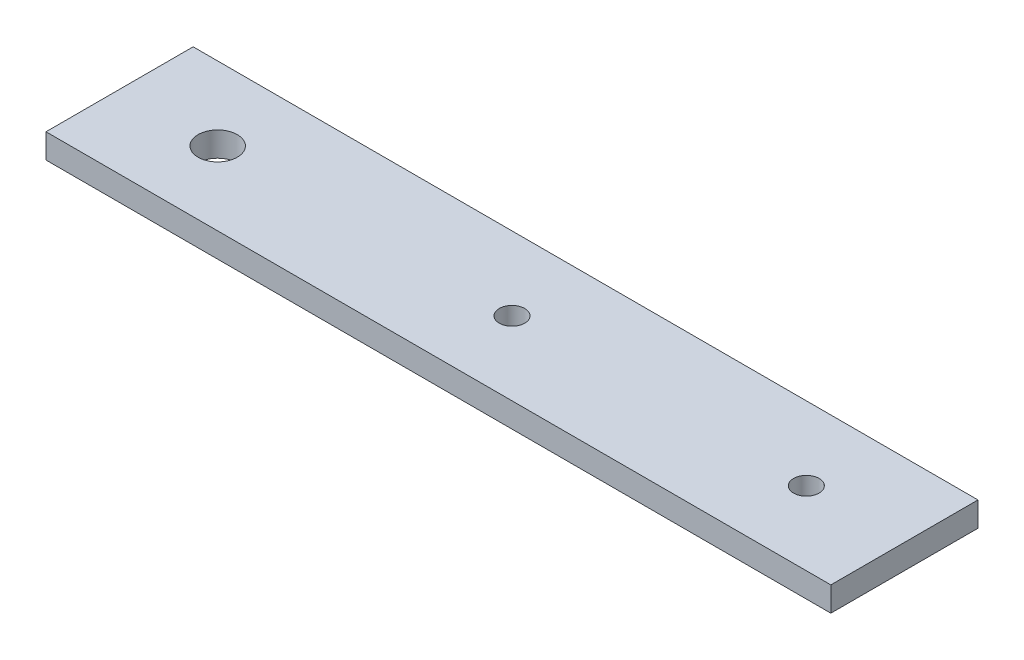
ISO-10303-21;
HEADER;
FILE_DESCRIPTION(('STEP AP214'),'2;1');
FILE_NAME('part.step','',(''),(''),'','','');
FILE_SCHEMA(('AUTOMOTIVE_DESIGN { 1 0 10303 214 1 1 1 1 }'));
ENDSEC;
DATA;
#1=APPLICATION_CONTEXT('core data for automotive mechanical design processes');
#2=APPLICATION_PROTOCOL_DEFINITION('international standard','automotive_design',2000,#1);
#3=PRODUCT_CONTEXT('',#1,'mechanical');
#4=PRODUCT('Part','Part','',(#3));
#5=PRODUCT_RELATED_PRODUCT_CATEGORY('part','',(#4));
#6=PRODUCT_DEFINITION_FORMATION('','',#4);
#7=PRODUCT_DEFINITION_CONTEXT('part definition',#1,'design');
#8=PRODUCT_DEFINITION('design','',#6,#7);
#9=PRODUCT_DEFINITION_SHAPE('','',#8);
#10=(LENGTH_UNIT() NAMED_UNIT(*) SI_UNIT(.MILLI.,.METRE.));
#11=(NAMED_UNIT(*) PLANE_ANGLE_UNIT() SI_UNIT($,.RADIAN.));
#12=(NAMED_UNIT(*) SI_UNIT($,.STERADIAN.) SOLID_ANGLE_UNIT());
#13=UNCERTAINTY_MEASURE_WITH_UNIT(LENGTH_MEASURE(1.E-05),#10,'distance_accuracy_value','');
#14=(GEOMETRIC_REPRESENTATION_CONTEXT(3) GLOBAL_UNCERTAINTY_ASSIGNED_CONTEXT((#13)) GLOBAL_UNIT_ASSIGNED_CONTEXT((#10,
#11,#12)) REPRESENTATION_CONTEXT('',''));
#15=CARTESIAN_POINT('',(0.,0.,0.));
#16=DIRECTION('',(0.,0.,1.));
#17=DIRECTION('',(1.,0.,0.));
#18=AXIS2_PLACEMENT_3D('',#15,#16,#17);
#19=CARTESIAN_POINT('',(0.,3.175,0.));
#20=DIRECTION('',(0.,-1.,0.));
#21=DIRECTION('',(0.,0.,-1.));
#22=AXIS2_PLACEMENT_3D('',#19,#20,#21);
#23=PLANE('',#22);
#24=CARTESIAN_POINT('',(50.8,3.175,-9.52499999999999));
#25=DIRECTION('',(0.,1.,0.));
#26=DIRECTION('',(0.,0.,1.));
#27=AXIS2_PLACEMENT_3D('',#24,#25,#26);
#28=CIRCLE('',#27,1.651);
#29=CARTESIAN_POINT('',(50.8,3.175,-7.87399999999999));
#30=VERTEX_POINT('',#29);
#31=EDGE_CURVE('E110',#30,#30,#28,.T.);
#32=ORIENTED_EDGE('',*,*,#31,.F.);
#33=EDGE_LOOP('',(#32));
#34=FACE_BOUND('',#33,.T.);
#35=DIRECTION('',(0.,0.,-1.));
#36=VECTOR('',#35,1.);
#37=CARTESIAN_POINT('',(0.,3.175,0.));
#38=LINE('',#37,#36);
#39=CARTESIAN_POINT('',(0.,3.175,0.));
#40=VERTEX_POINT('',#39);
#41=CARTESIAN_POINT('',(0.,3.175,-19.05));
#42=VERTEX_POINT('',#41);
#43=EDGE_CURVE('E89',#40,#42,#38,.T.);
#44=ORIENTED_EDGE('',*,*,#43,.F.);
#45=DIRECTION('',(1.,0.,0.));
#46=VECTOR('',#45,1.);
#47=CARTESIAN_POINT('',(0.,3.175,0.));
#48=LINE('',#47,#46);
#49=CARTESIAN_POINT('',(101.6,3.175,0.));
#50=VERTEX_POINT('',#49);
#51=EDGE_CURVE('E92',#40,#50,#48,.T.);
#52=ORIENTED_EDGE('',*,*,#51,.T.);
#53=DIRECTION('',(0.,0.,1.));
#54=VECTOR('',#53,1.);
#55=CARTESIAN_POINT('',(101.6,3.175,-19.05));
#56=LINE('',#55,#54);
#57=CARTESIAN_POINT('',(101.6,3.175,-19.05));
#58=VERTEX_POINT('',#57);
#59=EDGE_CURVE('E82',#58,#50,#56,.T.);
#60=ORIENTED_EDGE('',*,*,#59,.F.);
#61=DIRECTION('',(-1.,0.,0.));
#62=VECTOR('',#61,1.);
#63=CARTESIAN_POINT('',(101.6,3.175,-19.05));
#64=LINE('',#63,#62);
#65=EDGE_CURVE('E77',#58,#42,#64,.T.);
#66=ORIENTED_EDGE('',*,*,#65,.T.);
#67=EDGE_LOOP('',(#44,#52,#60,#66));
#68=FACE_BOUND('',#67,.T.);
#69=CARTESIAN_POINT('',(12.7,3.175,-9.52499999999999));
#70=DIRECTION('',(0.,1.,0.));
#71=DIRECTION('',(0.,0.,1.));
#72=AXIS2_PLACEMENT_3D('',#69,#70,#71);
#73=CIRCLE('',#72,2.54);
#74=CARTESIAN_POINT('',(12.7,3.175,-6.98499999999999));
#75=VERTEX_POINT('',#74);
#76=EDGE_CURVE('E101',#75,#75,#73,.T.);
#77=ORIENTED_EDGE('',*,*,#76,.F.);
#78=EDGE_LOOP('',(#77));
#79=FACE_BOUND('',#78,.T.);
#80=CARTESIAN_POINT('',(88.9,3.175,-9.52499999999999));
#81=DIRECTION('',(0.,1.,0.));
#82=DIRECTION('',(0.,0.,1.));
#83=AXIS2_PLACEMENT_3D('',#80,#81,#82);
#84=CIRCLE('',#83,1.65100000000001);
#85=CARTESIAN_POINT('',(88.9,3.175,-7.87399999999998));
#86=VERTEX_POINT('',#85);
#87=EDGE_CURVE('E116',#86,#86,#84,.T.);
#88=ORIENTED_EDGE('',*,*,#87,.F.);
#89=EDGE_LOOP('',(#88));
#90=FACE_BOUND('',#89,.T.);
#91=ADVANCED_FACE('F32',(#34,#68,#79,#90),#23,.F.);
#92=CARTESIAN_POINT('',(0.,0.,0.));
#93=DIRECTION('',(0.,-1.,0.));
#94=DIRECTION('',(0.,0.,-1.));
#95=AXIS2_PLACEMENT_3D('',#92,#93,#94);
#96=PLANE('',#95);
#97=CARTESIAN_POINT('',(50.8,0.,-9.52499999999999));
#98=DIRECTION('',(0.,1.,0.));
#99=DIRECTION('',(0.,0.,1.));
#100=AXIS2_PLACEMENT_3D('',#97,#98,#99);
#101=CIRCLE('',#100,1.651);
#102=CARTESIAN_POINT('',(50.8,0.,-7.87399999999999));
#103=VERTEX_POINT('',#102);
#104=EDGE_CURVE('E113',#103,#103,#101,.T.);
#105=ORIENTED_EDGE('',*,*,#104,.T.);
#106=EDGE_LOOP('',(#105));
#107=FACE_BOUND('',#106,.T.);
#108=DIRECTION('',(0.,0.,-1.));
#109=VECTOR('',#108,1.);
#110=CARTESIAN_POINT('',(0.,0.,0.));
#111=LINE('',#110,#109);
#112=CARTESIAN_POINT('',(0.,0.,0.));
#113=VERTEX_POINT('',#112);
#114=CARTESIAN_POINT('',(0.,0.,-19.05));
#115=VERTEX_POINT('',#114);
#116=EDGE_CURVE('E97',#113,#115,#111,.T.);
#117=ORIENTED_EDGE('',*,*,#116,.T.);
#118=DIRECTION('',(-1.,0.,0.));
#119=VECTOR('',#118,1.);
#120=CARTESIAN_POINT('',(101.6,0.,-19.05));
#121=LINE('',#120,#119);
#122=CARTESIAN_POINT('',(101.6,0.,-19.05));
#123=VERTEX_POINT('',#122);
#124=EDGE_CURVE('E100',#123,#115,#121,.T.);
#125=ORIENTED_EDGE('',*,*,#124,.F.);
#126=DIRECTION('',(0.,0.,1.));
#127=VECTOR('',#126,1.);
#128=CARTESIAN_POINT('',(101.6,0.,-19.05));
#129=LINE('',#128,#127);
#130=CARTESIAN_POINT('',(101.6,0.,0.));
#131=VERTEX_POINT('',#130);
#132=EDGE_CURVE('E84',#123,#131,#129,.T.);
#133=ORIENTED_EDGE('',*,*,#132,.T.);
#134=DIRECTION('',(1.,0.,0.));
#135=VECTOR('',#134,1.);
#136=CARTESIAN_POINT('',(0.,0.,0.));
#137=LINE('',#136,#135);
#138=EDGE_CURVE('E104',#113,#131,#137,.T.);
#139=ORIENTED_EDGE('',*,*,#138,.F.);
#140=EDGE_LOOP('',(#117,#125,#133,#139));
#141=FACE_BOUND('',#140,.T.);
#142=CARTESIAN_POINT('',(12.7,0.,-9.52499999999999));
#143=DIRECTION('',(0.,1.,0.));
#144=DIRECTION('',(0.,0.,1.));
#145=AXIS2_PLACEMENT_3D('',#142,#143,#144);
#146=CIRCLE('',#145,2.54);
#147=CARTESIAN_POINT('',(12.7,0.,-6.98499999999999));
#148=VERTEX_POINT('',#147);
#149=EDGE_CURVE('E107',#148,#148,#146,.T.);
#150=ORIENTED_EDGE('',*,*,#149,.T.);
#151=EDGE_LOOP('',(#150));
#152=FACE_BOUND('',#151,.T.);
#153=CARTESIAN_POINT('',(88.9,0.,-9.52499999999999));
#154=DIRECTION('',(0.,1.,0.));
#155=DIRECTION('',(0.,0.,1.));
#156=AXIS2_PLACEMENT_3D('',#153,#154,#155);
#157=CIRCLE('',#156,1.65100000000001);
#158=CARTESIAN_POINT('',(88.9,0.,-7.87399999999998));
#159=VERTEX_POINT('',#158);
#160=EDGE_CURVE('E119',#159,#159,#157,.T.);
#161=ORIENTED_EDGE('',*,*,#160,.T.);
#162=EDGE_LOOP('',(#161));
#163=FACE_BOUND('',#162,.T.);
#164=ADVANCED_FACE('F129',(#107,#141,#152,#163),#96,.T.);
#165=CARTESIAN_POINT('',(0.,3.175,0.));
#166=DIRECTION('',(-1.,0.,0.));
#167=DIRECTION('',(0.,0.,1.));
#168=AXIS2_PLACEMENT_3D('',#165,#166,#167);
#169=PLANE('',#168);
#170=ORIENTED_EDGE('',*,*,#116,.F.);
#171=DIRECTION('',(0.,-1.,0.));
#172=VECTOR('',#171,1.);
#173=CARTESIAN_POINT('',(0.,3.175,0.));
#174=LINE('',#173,#172);
#175=EDGE_CURVE('E11',#40,#113,#174,.T.);
#176=ORIENTED_EDGE('',*,*,#175,.F.);
#177=ORIENTED_EDGE('',*,*,#43,.T.);
#178=DIRECTION('',(0.,-1.,0.));
#179=VECTOR('',#178,1.);
#180=CARTESIAN_POINT('',(0.,3.175,-19.05));
#181=LINE('',#180,#179);
#182=EDGE_CURVE('E36',#42,#115,#181,.T.);
#183=ORIENTED_EDGE('',*,*,#182,.T.);
#184=EDGE_LOOP('',(#170,#176,#177,#183));
#185=FACE_BOUND('',#184,.T.);
#186=ADVANCED_FACE('F34',(#185),#169,.T.);
#187=CARTESIAN_POINT('',(0.,3.175,0.));
#188=DIRECTION('',(0.,0.,-1.));
#189=DIRECTION('',(-1.,0.,0.));
#190=AXIS2_PLACEMENT_3D('',#187,#188,#189);
#191=PLANE('',#190);
#192=ORIENTED_EDGE('',*,*,#138,.T.);
#193=DIRECTION('',(0.,-1.,0.));
#194=VECTOR('',#193,1.);
#195=CARTESIAN_POINT('',(101.6,3.175,0.));
#196=LINE('',#195,#194);
#197=EDGE_CURVE('E42',#50,#131,#196,.T.);
#198=ORIENTED_EDGE('',*,*,#197,.F.);
#199=ORIENTED_EDGE('',*,*,#51,.F.);
#200=ORIENTED_EDGE('',*,*,#175,.T.);
#201=EDGE_LOOP('',(#192,#198,#199,#200));
#202=FACE_BOUND('',#201,.T.);
#203=ADVANCED_FACE('F142',(#202),#191,.F.);
#204=CARTESIAN_POINT('',(101.6,3.175,-19.05));
#205=DIRECTION('',(1.,0.,0.));
#206=DIRECTION('',(0.,0.,-1.));
#207=AXIS2_PLACEMENT_3D('',#204,#205,#206);
#208=PLANE('',#207);
#209=ORIENTED_EDGE('',*,*,#132,.F.);
#210=DIRECTION('',(0.,-1.,0.));
#211=VECTOR('',#210,1.);
#212=CARTESIAN_POINT('',(101.6,3.175,-19.05));
#213=LINE('',#212,#211);
#214=EDGE_CURVE('E80',#58,#123,#213,.T.);
#215=ORIENTED_EDGE('',*,*,#214,.F.);
#216=ORIENTED_EDGE('',*,*,#59,.T.);
#217=ORIENTED_EDGE('',*,*,#197,.T.);
#218=EDGE_LOOP('',(#209,#215,#216,#217));
#219=FACE_BOUND('',#218,.T.);
#220=ADVANCED_FACE('F81',(#219),#208,.T.);
#221=CARTESIAN_POINT('',(101.6,3.175,-19.05));
#222=DIRECTION('',(0.,0.,1.));
#223=DIRECTION('',(1.,0.,0.));
#224=AXIS2_PLACEMENT_3D('',#221,#222,#223);
#225=PLANE('',#224);
#226=ORIENTED_EDGE('',*,*,#124,.T.);
#227=ORIENTED_EDGE('',*,*,#182,.F.);
#228=ORIENTED_EDGE('',*,*,#65,.F.);
#229=ORIENTED_EDGE('',*,*,#214,.T.);
#230=EDGE_LOOP('',(#226,#227,#228,#229));
#231=FACE_BOUND('',#230,.T.);
#232=ADVANCED_FACE('F88',(#231),#225,.F.);
#233=CARTESIAN_POINT('',(12.7,3.175,-9.52499999999999));
#234=DIRECTION('',(0.,-1.,0.));
#235=DIRECTION('',(0.,0.,-1.));
#236=AXIS2_PLACEMENT_3D('',#233,#234,#235);
#237=CYLINDRICAL_SURFACE('',#236,2.54);
#238=ORIENTED_EDGE('',*,*,#76,.T.);
#239=EDGE_LOOP('',(#238));
#240=FACE_BOUND('',#239,.T.);
#241=ORIENTED_EDGE('',*,*,#149,.F.);
#242=EDGE_LOOP('',(#241));
#243=FACE_BOUND('',#242,.T.);
#244=ADVANCED_FACE('F139',(#240,#243),#237,.F.);
#245=CARTESIAN_POINT('',(50.8,3.175,-9.52499999999999));
#246=DIRECTION('',(0.,-1.,0.));
#247=DIRECTION('',(0.,0.,-1.));
#248=AXIS2_PLACEMENT_3D('',#245,#246,#247);
#249=CYLINDRICAL_SURFACE('',#248,1.651);
#250=ORIENTED_EDGE('',*,*,#31,.T.);
#251=EDGE_LOOP('',(#250));
#252=FACE_BOUND('',#251,.T.);
#253=ORIENTED_EDGE('',*,*,#104,.F.);
#254=EDGE_LOOP('',(#253));
#255=FACE_BOUND('',#254,.T.);
#256=ADVANCED_FACE('F150',(#252,#255),#249,.F.);
#257=CARTESIAN_POINT('',(88.9,3.175,-9.52499999999999));
#258=DIRECTION('',(0.,-1.,0.));
#259=DIRECTION('',(0.,0.,-1.));
#260=AXIS2_PLACEMENT_3D('',#257,#258,#259);
#261=CYLINDRICAL_SURFACE('',#260,1.65100000000001);
#262=ORIENTED_EDGE('',*,*,#87,.T.);
#263=EDGE_LOOP('',(#262));
#264=FACE_BOUND('',#263,.T.);
#265=ORIENTED_EDGE('',*,*,#160,.F.);
#266=EDGE_LOOP('',(#265));
#267=FACE_BOUND('',#266,.T.);
#268=ADVANCED_FACE('F125',(#264,#267),#261,.F.);
#269=CLOSED_SHELL('',(#91,#164,#186,#203,#220,#232,#244,#256,#268));
#270=MANIFOLD_SOLID_BREP('B2',#269);
#271=ADVANCED_BREP_SHAPE_REPRESENTATION('',(#18,#270),#14);
#272=SHAPE_DEFINITION_REPRESENTATION(#9,#271);
ENDSEC;
END-ISO-10303-21;
